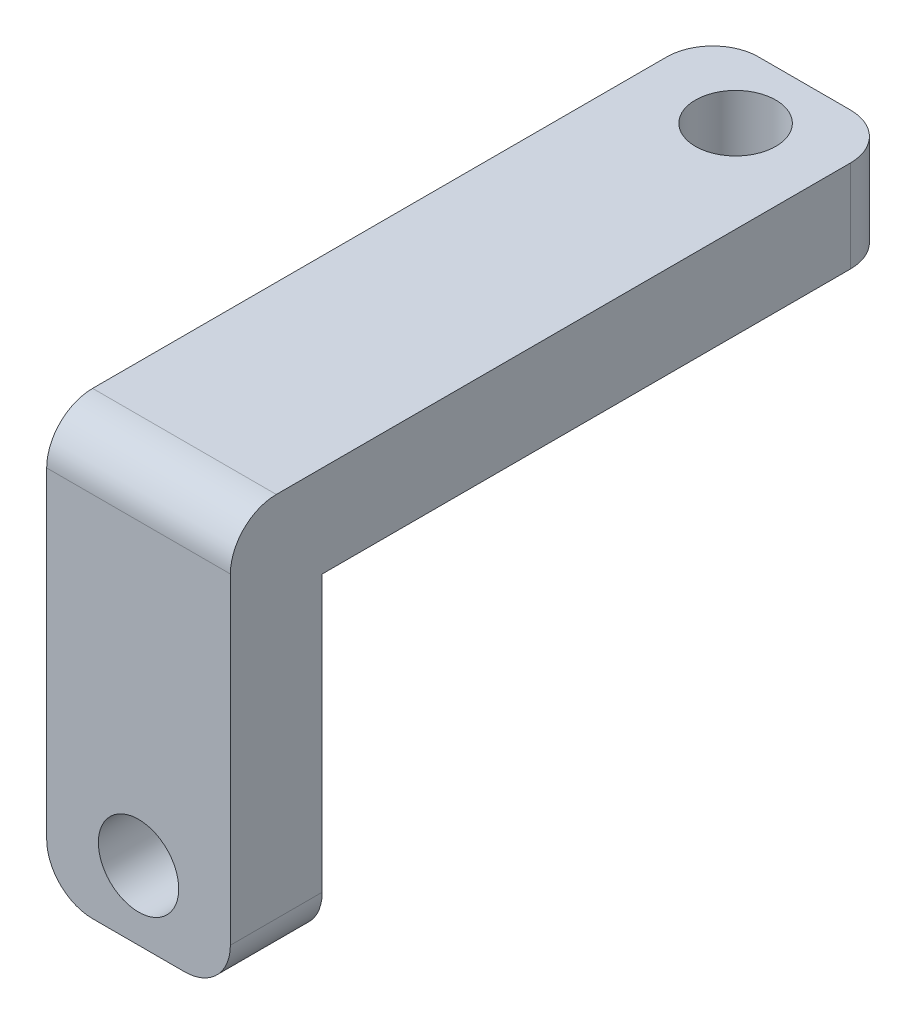
ISO-10303-21;
HEADER;
FILE_DESCRIPTION(('STEP AP214'),'2;1');
FILE_NAME('part.step','',(''),(''),'','','');
FILE_SCHEMA(('AUTOMOTIVE_DESIGN { 1 0 10303 214 1 1 1 1 }'));
ENDSEC;
DATA;
#1=APPLICATION_CONTEXT('core data for automotive mechanical design processes');
#2=APPLICATION_PROTOCOL_DEFINITION('international standard','automotive_design',2000,#1);
#3=PRODUCT_CONTEXT('',#1,'mechanical');
#4=PRODUCT('Part','Part','',(#3));
#5=PRODUCT_RELATED_PRODUCT_CATEGORY('part','',(#4));
#6=PRODUCT_DEFINITION_FORMATION('','',#4);
#7=PRODUCT_DEFINITION_CONTEXT('part definition',#1,'design');
#8=PRODUCT_DEFINITION('design','',#6,#7);
#9=PRODUCT_DEFINITION_SHAPE('','',#8);
#10=(LENGTH_UNIT() NAMED_UNIT(*) SI_UNIT(.MILLI.,.METRE.));
#11=(NAMED_UNIT(*) PLANE_ANGLE_UNIT() SI_UNIT($,.RADIAN.));
#12=(NAMED_UNIT(*) SI_UNIT($,.STERADIAN.) SOLID_ANGLE_UNIT());
#13=UNCERTAINTY_MEASURE_WITH_UNIT(LENGTH_MEASURE(1.E-05),#10,'distance_accuracy_value','');
#14=(GEOMETRIC_REPRESENTATION_CONTEXT(3) GLOBAL_UNCERTAINTY_ASSIGNED_CONTEXT((#13)) GLOBAL_UNIT_ASSIGNED_CONTEXT((#10,
#11,#12)) REPRESENTATION_CONTEXT('',''));
#15=CARTESIAN_POINT('',(0.,0.,0.));
#16=DIRECTION('',(0.,0.,1.));
#17=DIRECTION('',(1.,0.,0.));
#18=AXIS2_PLACEMENT_3D('',#15,#16,#17);
#19=CARTESIAN_POINT('',(0.,4.,0.));
#20=DIRECTION('',(0.,1.,0.));
#21=DIRECTION('',(0.,0.,1.));
#22=AXIS2_PLACEMENT_3D('',#19,#20,#21);
#23=PLANE('',#22);
#24=DIRECTION('',(0.,0.,1.));
#25=VECTOR('',#24,1.);
#26=CARTESIAN_POINT('',(-4.,4.,-12.5));
#27=LINE('',#26,#25);
#28=CARTESIAN_POINT('',(-4.,4.,-10.5));
#29=VERTEX_POINT('',#28);
#30=CARTESIAN_POINT('',(-4.,4.,14.5));
#31=VERTEX_POINT('',#30);
#32=EDGE_CURVE('E152',#29,#31,#27,.T.);
#33=ORIENTED_EDGE('',*,*,#32,.T.);
#34=DIRECTION('',(-1.,0.,0.));
#35=VECTOR('',#34,1.);
#36=CARTESIAN_POINT('',(0.,4.,14.5));
#37=LINE('',#36,#35);
#38=CARTESIAN_POINT('',(4.,4.,14.5));
#39=VERTEX_POINT('',#38);
#40=EDGE_CURVE('E172',#31,#39,#37,.F.);
#41=ORIENTED_EDGE('',*,*,#40,.T.);
#42=DIRECTION('',(0.,0.,-1.));
#43=VECTOR('',#42,1.);
#44=CARTESIAN_POINT('',(4.,4.,-12.5));
#45=LINE('',#44,#43);
#46=CARTESIAN_POINT('',(4.,4.,-10.5));
#47=VERTEX_POINT('',#46);
#48=EDGE_CURVE('E200',#39,#47,#45,.T.);
#49=ORIENTED_EDGE('',*,*,#48,.T.);
#50=CARTESIAN_POINT('',(2.,4.,-10.5));
#51=DIRECTION('',(0.,1.,0.));
#52=DIRECTION('',(0.,0.,1.));
#53=AXIS2_PLACEMENT_3D('',#50,#51,#52);
#54=CIRCLE('',#53,2.);
#55=CARTESIAN_POINT('',(2.,4.,-12.5));
#56=VERTEX_POINT('',#55);
#57=EDGE_CURVE('E168',#47,#56,#54,.T.);
#58=ORIENTED_EDGE('',*,*,#57,.T.);
#59=DIRECTION('',(-1.,0.,0.));
#60=VECTOR('',#59,1.);
#61=CARTESIAN_POINT('',(-4.,4.,-12.5));
#62=LINE('',#61,#60);
#63=CARTESIAN_POINT('',(-2.,4.,-12.5));
#64=VERTEX_POINT('',#63);
#65=EDGE_CURVE('E156',#56,#64,#62,.T.);
#66=ORIENTED_EDGE('',*,*,#65,.T.);
#67=CARTESIAN_POINT('',(-2.,4.,-10.5));
#68=DIRECTION('',(0.,1.,0.));
#69=DIRECTION('',(0.,0.,1.));
#70=AXIS2_PLACEMENT_3D('',#67,#68,#69);
#71=CIRCLE('',#70,2.);
#72=EDGE_CURVE('E170',#64,#29,#71,.T.);
#73=ORIENTED_EDGE('',*,*,#72,.T.);
#74=EDGE_LOOP('',(#33,#41,#49,#58,#66,#73));
#75=FACE_BOUND('',#74,.T.);
#76=CARTESIAN_POINT('',(0.,4.,-9.5));
#77=DIRECTION('',(0.,1.,0.));
#78=DIRECTION('',(0.,0.,1.));
#79=AXIS2_PLACEMENT_3D('',#76,#77,#78);
#80=CIRCLE('',#79,1.75);
#81=CARTESIAN_POINT('',(0.,4.,-7.75));
#82=VERTEX_POINT('',#81);
#83=EDGE_CURVE('E147',#82,#82,#80,.T.);
#84=ORIENTED_EDGE('',*,*,#83,.F.);
#85=EDGE_LOOP('',(#84));
#86=FACE_BOUND('',#85,.T.);
#87=ADVANCED_FACE('F37',(#75,#86),#23,.T.);
#88=CARTESIAN_POINT('',(0.,0.,0.));
#89=DIRECTION('',(0.,1.,0.));
#90=DIRECTION('',(0.,0.,1.));
#91=AXIS2_PLACEMENT_3D('',#88,#89,#90);
#92=PLANE('',#91);
#93=DIRECTION('',(0.,0.,1.));
#94=VECTOR('',#93,1.);
#95=CARTESIAN_POINT('',(-4.,0.,-12.5));
#96=LINE('',#95,#94);
#97=CARTESIAN_POINT('',(-4.,0.,-10.5));
#98=VERTEX_POINT('',#97);
#99=CARTESIAN_POINT('',(-4.,0.,12.5));
#100=VERTEX_POINT('',#99);
#101=EDGE_CURVE('E145',#98,#100,#96,.T.);
#102=ORIENTED_EDGE('',*,*,#101,.F.);
#103=CARTESIAN_POINT('',(-2.,0.,-10.5));
#104=DIRECTION('',(0.,1.,0.));
#105=DIRECTION('',(0.,0.,1.));
#106=AXIS2_PLACEMENT_3D('',#103,#104,#105);
#107=CIRCLE('',#106,2.);
#108=CARTESIAN_POINT('',(-2.,0.,-12.5));
#109=VERTEX_POINT('',#108);
#110=EDGE_CURVE('E52',#98,#109,#107,.F.);
#111=ORIENTED_EDGE('',*,*,#110,.T.);
#112=DIRECTION('',(-1.,0.,0.));
#113=VECTOR('',#112,1.);
#114=CARTESIAN_POINT('',(-4.,0.,-12.5));
#115=LINE('',#114,#113);
#116=CARTESIAN_POINT('',(2.,0.,-12.5));
#117=VERTEX_POINT('',#116);
#118=EDGE_CURVE('E140',#117,#109,#115,.T.);
#119=ORIENTED_EDGE('',*,*,#118,.F.);
#120=CARTESIAN_POINT('',(2.,0.,-10.5));
#121=DIRECTION('',(0.,1.,0.));
#122=DIRECTION('',(0.,0.,1.));
#123=AXIS2_PLACEMENT_3D('',#120,#121,#122);
#124=CIRCLE('',#123,2.);
#125=CARTESIAN_POINT('',(4.,0.,-10.5));
#126=VERTEX_POINT('',#125);
#127=EDGE_CURVE('E60',#117,#126,#124,.F.);
#128=ORIENTED_EDGE('',*,*,#127,.T.);
#129=DIRECTION('',(0.,0.,-1.));
#130=VECTOR('',#129,1.);
#131=CARTESIAN_POINT('',(4.,0.,-12.5));
#132=LINE('',#131,#130);
#133=CARTESIAN_POINT('',(4.,0.,12.5));
#134=VERTEX_POINT('',#133);
#135=EDGE_CURVE('E126',#134,#126,#132,.T.);
#136=ORIENTED_EDGE('',*,*,#135,.F.);
#137=DIRECTION('',(1.,0.,0.));
#138=VECTOR('',#137,1.);
#139=CARTESIAN_POINT('',(-4.,0.,12.5));
#140=LINE('',#139,#138);
#141=EDGE_CURVE('E138',#100,#134,#140,.T.);
#142=ORIENTED_EDGE('',*,*,#141,.F.);
#143=EDGE_LOOP('',(#102,#111,#119,#128,#136,#142));
#144=FACE_BOUND('',#143,.T.);
#145=CARTESIAN_POINT('',(0.,0.,-9.5));
#146=DIRECTION('',(0.,1.,0.));
#147=DIRECTION('',(0.,0.,1.));
#148=AXIS2_PLACEMENT_3D('',#145,#146,#147);
#149=CIRCLE('',#148,1.75);
#150=CARTESIAN_POINT('',(0.,0.,-7.75));
#151=VERTEX_POINT('',#150);
#152=EDGE_CURVE('E206',#151,#151,#149,.T.);
#153=ORIENTED_EDGE('',*,*,#152,.T.);
#154=EDGE_LOOP('',(#153));
#155=FACE_BOUND('',#154,.T.);
#156=ADVANCED_FACE('F136',(#144,#155),#92,.F.);
#157=CARTESIAN_POINT('',(-4.,4.,-12.5));
#158=DIRECTION('',(1.,0.,0.));
#159=DIRECTION('',(0.,0.,-1.));
#160=AXIS2_PLACEMENT_3D('',#157,#158,#159);
#161=PLANE('',#160);
#162=DIRECTION('',(0.,-1.,0.));
#163=VECTOR('',#162,1.);
#164=CARTESIAN_POINT('',(-4.,4.,16.5));
#165=LINE('',#164,#163);
#166=CARTESIAN_POINT('',(-4.,2.,16.5));
#167=VERTEX_POINT('',#166);
#168=CARTESIAN_POINT('',(-4.,-12.,16.5));
#169=VERTEX_POINT('',#168);
#170=EDGE_CURVE('E132',#167,#169,#165,.T.);
#171=ORIENTED_EDGE('',*,*,#170,.F.);
#172=CARTESIAN_POINT('',(-4.,2.,14.5));
#173=DIRECTION('',(1.,0.,0.));
#174=DIRECTION('',(0.,0.,-1.));
#175=AXIS2_PLACEMENT_3D('',#172,#173,#174);
#176=CIRCLE('',#175,2.);
#177=EDGE_CURVE('E166',#167,#31,#176,.F.);
#178=ORIENTED_EDGE('',*,*,#177,.T.);
#179=ORIENTED_EDGE('',*,*,#32,.F.);
#180=DIRECTION('',(0.,-1.,0.));
#181=VECTOR('',#180,1.);
#182=CARTESIAN_POINT('',(-4.,4.,-10.5));
#183=LINE('',#182,#181);
#184=EDGE_CURVE('E161',#29,#98,#183,.T.);
#185=ORIENTED_EDGE('',*,*,#184,.T.);
#186=ORIENTED_EDGE('',*,*,#101,.T.);
#187=DIRECTION('',(0.,-1.,0.));
#188=VECTOR('',#187,1.);
#189=CARTESIAN_POINT('',(-4.,4.,12.5));
#190=LINE('',#189,#188);
#191=CARTESIAN_POINT('',(-4.,-12.,12.5));
#192=VERTEX_POINT('',#191);
#193=EDGE_CURVE('E144',#100,#192,#190,.T.);
#194=ORIENTED_EDGE('',*,*,#193,.T.);
#195=DIRECTION('',(0.,0.,-1.));
#196=VECTOR('',#195,1.);
#197=CARTESIAN_POINT('',(-4.,-12.,-12.5));
#198=LINE('',#197,#196);
#199=EDGE_CURVE('E164',#192,#169,#198,.F.);
#200=ORIENTED_EDGE('',*,*,#199,.T.);
#201=EDGE_LOOP('',(#171,#178,#179,#185,#186,#194,#200));
#202=FACE_BOUND('',#201,.T.);
#203=ADVANCED_FACE('F252',(#202),#161,.F.);
#204=CARTESIAN_POINT('',(4.,4.,-12.5));
#205=DIRECTION('',(-1.,0.,0.));
#206=DIRECTION('',(0.,0.,1.));
#207=AXIS2_PLACEMENT_3D('',#204,#205,#206);
#208=PLANE('',#207);
#209=ORIENTED_EDGE('',*,*,#48,.F.);
#210=CARTESIAN_POINT('',(4.,2.,14.5));
#211=DIRECTION('',(-1.,0.,0.));
#212=DIRECTION('',(0.,0.,1.));
#213=AXIS2_PLACEMENT_3D('',#210,#211,#212);
#214=CIRCLE('',#213,2.);
#215=CARTESIAN_POINT('',(4.,2.,16.5));
#216=VERTEX_POINT('',#215);
#217=EDGE_CURVE('E177',#39,#216,#214,.F.);
#218=ORIENTED_EDGE('',*,*,#217,.T.);
#219=DIRECTION('',(0.,1.,0.));
#220=VECTOR('',#219,1.);
#221=CARTESIAN_POINT('',(4.,4.,16.5));
#222=LINE('',#221,#220);
#223=CARTESIAN_POINT('',(4.,-12.,16.5));
#224=VERTEX_POINT('',#223);
#225=EDGE_CURVE('E209',#224,#216,#222,.T.);
#226=ORIENTED_EDGE('',*,*,#225,.F.);
#227=DIRECTION('',(0.,0.,-1.));
#228=VECTOR('',#227,1.);
#229=CARTESIAN_POINT('',(4.,-12.,-12.5));
#230=LINE('',#229,#228);
#231=CARTESIAN_POINT('',(4.,-12.,12.5));
#232=VERTEX_POINT('',#231);
#233=EDGE_CURVE('E129',#224,#232,#230,.T.);
#234=ORIENTED_EDGE('',*,*,#233,.T.);
#235=DIRECTION('',(0.,1.,0.));
#236=VECTOR('',#235,1.);
#237=CARTESIAN_POINT('',(4.,4.,12.5));
#238=LINE('',#237,#236);
#239=EDGE_CURVE('E122',#232,#134,#238,.T.);
#240=ORIENTED_EDGE('',*,*,#239,.T.);
#241=ORIENTED_EDGE('',*,*,#135,.T.);
#242=DIRECTION('',(0.,-1.,0.));
#243=VECTOR('',#242,1.);
#244=CARTESIAN_POINT('',(4.,4.,-10.5));
#245=LINE('',#244,#243);
#246=EDGE_CURVE('E174',#126,#47,#245,.F.);
#247=ORIENTED_EDGE('',*,*,#246,.T.);
#248=EDGE_LOOP('',(#209,#218,#226,#234,#240,#241,#247));
#249=FACE_BOUND('',#248,.T.);
#250=ADVANCED_FACE('F125',(#249),#208,.F.);
#251=CARTESIAN_POINT('',(-4.,4.,-12.5));
#252=DIRECTION('',(0.,0.,1.));
#253=DIRECTION('',(1.,0.,0.));
#254=AXIS2_PLACEMENT_3D('',#251,#252,#253);
#255=PLANE('',#254);
#256=ORIENTED_EDGE('',*,*,#118,.T.);
#257=DIRECTION('',(0.,-1.,0.));
#258=VECTOR('',#257,1.);
#259=CARTESIAN_POINT('',(-2.,4.,-12.5));
#260=LINE('',#259,#258);
#261=EDGE_CURVE('E11',#109,#64,#260,.F.);
#262=ORIENTED_EDGE('',*,*,#261,.T.);
#263=ORIENTED_EDGE('',*,*,#65,.F.);
#264=DIRECTION('',(0.,-1.,0.));
#265=VECTOR('',#264,1.);
#266=CARTESIAN_POINT('',(2.,4.,-12.5));
#267=LINE('',#266,#265);
#268=EDGE_CURVE('E45',#56,#117,#267,.T.);
#269=ORIENTED_EDGE('',*,*,#268,.T.);
#270=EDGE_LOOP('',(#256,#262,#263,#269));
#271=FACE_BOUND('',#270,.T.);
#272=ADVANCED_FACE('F191',(#271),#255,.F.);
#273=CARTESIAN_POINT('',(0.,4.,-9.5));
#274=DIRECTION('',(0.,-1.,0.));
#275=DIRECTION('',(0.,0.,-1.));
#276=AXIS2_PLACEMENT_3D('',#273,#274,#275);
#277=CYLINDRICAL_SURFACE('',#276,1.75);
#278=ORIENTED_EDGE('',*,*,#83,.T.);
#279=EDGE_LOOP('',(#278));
#280=FACE_BOUND('',#279,.T.);
#281=ORIENTED_EDGE('',*,*,#152,.F.);
#282=EDGE_LOOP('',(#281));
#283=FACE_BOUND('',#282,.T.);
#284=ADVANCED_FACE('F243',(#280,#283),#277,.F.);
#285=CARTESIAN_POINT('',(0.,0.,12.5));
#286=DIRECTION('',(0.,0.,1.));
#287=DIRECTION('',(1.,0.,0.));
#288=AXIS2_PLACEMENT_3D('',#285,#286,#287);
#289=PLANE('',#288);
#290=CARTESIAN_POINT('',(0.,-11.,12.5));
#291=DIRECTION('',(0.,0.,1.));
#292=DIRECTION('',(1.,0.,0.));
#293=AXIS2_PLACEMENT_3D('',#290,#291,#292);
#294=CIRCLE('',#293,1.75);
#295=CARTESIAN_POINT('',(1.75,-11.,12.5));
#296=VERTEX_POINT('',#295);
#297=EDGE_CURVE('E223',#296,#296,#294,.T.);
#298=ORIENTED_EDGE('',*,*,#297,.T.);
#299=EDGE_LOOP('',(#298));
#300=FACE_BOUND('',#299,.T.);
#301=ORIENTED_EDGE('',*,*,#239,.F.);
#302=CARTESIAN_POINT('',(2.,-12.,12.5));
#303=DIRECTION('',(0.,0.,1.));
#304=DIRECTION('',(1.,0.,0.));
#305=AXIS2_PLACEMENT_3D('',#302,#303,#304);
#306=CIRCLE('',#305,2.);
#307=CARTESIAN_POINT('',(2.,-14.,12.5));
#308=VERTEX_POINT('',#307);
#309=EDGE_CURVE('E181',#232,#308,#306,.F.);
#310=ORIENTED_EDGE('',*,*,#309,.T.);
#311=DIRECTION('',(1.,0.,0.));
#312=VECTOR('',#311,1.);
#313=CARTESIAN_POINT('',(-4.,-14.,12.5));
#314=LINE('',#313,#312);
#315=CARTESIAN_POINT('',(-2.,-14.,12.5));
#316=VERTEX_POINT('',#315);
#317=EDGE_CURVE('E133',#316,#308,#314,.T.);
#318=ORIENTED_EDGE('',*,*,#317,.F.);
#319=CARTESIAN_POINT('',(-2.,-12.,12.5));
#320=DIRECTION('',(0.,0.,1.));
#321=DIRECTION('',(1.,0.,0.));
#322=AXIS2_PLACEMENT_3D('',#319,#320,#321);
#323=CIRCLE('',#322,2.);
#324=EDGE_CURVE('E179',#316,#192,#323,.F.);
#325=ORIENTED_EDGE('',*,*,#324,.T.);
#326=ORIENTED_EDGE('',*,*,#193,.F.);
#327=ORIENTED_EDGE('',*,*,#141,.T.);
#328=EDGE_LOOP('',(#301,#310,#318,#325,#326,#327));
#329=FACE_BOUND('',#328,.T.);
#330=ADVANCED_FACE('F142',(#300,#329),#289,.F.);
#331=CARTESIAN_POINT('',(0.,0.,16.5));
#332=DIRECTION('',(0.,0.,1.));
#333=DIRECTION('',(1.,0.,0.));
#334=AXIS2_PLACEMENT_3D('',#331,#332,#333);
#335=PLANE('',#334);
#336=ORIENTED_EDGE('',*,*,#225,.T.);
#337=DIRECTION('',(-1.,0.,0.));
#338=VECTOR('',#337,1.);
#339=CARTESIAN_POINT('',(0.,2.,16.5));
#340=LINE('',#339,#338);
#341=EDGE_CURVE('E158',#216,#167,#340,.T.);
#342=ORIENTED_EDGE('',*,*,#341,.T.);
#343=ORIENTED_EDGE('',*,*,#170,.T.);
#344=CARTESIAN_POINT('',(-2.,-12.,16.5));
#345=DIRECTION('',(0.,0.,1.));
#346=DIRECTION('',(1.,0.,0.));
#347=AXIS2_PLACEMENT_3D('',#344,#345,#346);
#348=CIRCLE('',#347,2.);
#349=CARTESIAN_POINT('',(-2.,-14.,16.5));
#350=VERTEX_POINT('',#349);
#351=EDGE_CURVE('E153',#169,#350,#348,.T.);
#352=ORIENTED_EDGE('',*,*,#351,.T.);
#353=DIRECTION('',(1.,0.,0.));
#354=VECTOR('',#353,1.);
#355=CARTESIAN_POINT('',(-4.,-14.,16.5));
#356=LINE('',#355,#354);
#357=CARTESIAN_POINT('',(2.,-14.,16.5));
#358=VERTEX_POINT('',#357);
#359=EDGE_CURVE('E218',#350,#358,#356,.T.);
#360=ORIENTED_EDGE('',*,*,#359,.T.);
#361=CARTESIAN_POINT('',(2.,-12.,16.5));
#362=DIRECTION('',(0.,0.,1.));
#363=DIRECTION('',(1.,0.,0.));
#364=AXIS2_PLACEMENT_3D('',#361,#362,#363);
#365=CIRCLE('',#364,2.);
#366=EDGE_CURVE('E155',#358,#224,#365,.T.);
#367=ORIENTED_EDGE('',*,*,#366,.T.);
#368=EDGE_LOOP('',(#336,#342,#343,#352,#360,#367));
#369=FACE_BOUND('',#368,.T.);
#370=CARTESIAN_POINT('',(0.,-11.,16.5));
#371=DIRECTION('',(0.,0.,1.));
#372=DIRECTION('',(1.,0.,0.));
#373=AXIS2_PLACEMENT_3D('',#370,#371,#372);
#374=CIRCLE('',#373,1.75);
#375=CARTESIAN_POINT('',(1.75,-11.,16.5));
#376=VERTEX_POINT('',#375);
#377=EDGE_CURVE('E215',#376,#376,#374,.T.);
#378=ORIENTED_EDGE('',*,*,#377,.F.);
#379=EDGE_LOOP('',(#378));
#380=FACE_BOUND('',#379,.T.);
#381=ADVANCED_FACE('F232',(#369,#380),#335,.T.);
#382=CARTESIAN_POINT('',(-4.,-14.,16.5));
#383=DIRECTION('',(0.,1.,0.));
#384=DIRECTION('',(0.,0.,1.));
#385=AXIS2_PLACEMENT_3D('',#382,#383,#384);
#386=PLANE('',#385);
#387=ORIENTED_EDGE('',*,*,#317,.T.);
#388=DIRECTION('',(0.,0.,-1.));
#389=VECTOR('',#388,1.);
#390=CARTESIAN_POINT('',(2.,-14.,16.5));
#391=LINE('',#390,#389);
#392=EDGE_CURVE('E186',#308,#358,#391,.F.);
#393=ORIENTED_EDGE('',*,*,#392,.T.);
#394=ORIENTED_EDGE('',*,*,#359,.F.);
#395=DIRECTION('',(0.,0.,-1.));
#396=VECTOR('',#395,1.);
#397=CARTESIAN_POINT('',(-2.,-14.,16.5));
#398=LINE('',#397,#396);
#399=EDGE_CURVE('E183',#350,#316,#398,.T.);
#400=ORIENTED_EDGE('',*,*,#399,.T.);
#401=EDGE_LOOP('',(#387,#393,#394,#400));
#402=FACE_BOUND('',#401,.T.);
#403=ADVANCED_FACE('F234',(#402),#386,.F.);
#404=CARTESIAN_POINT('',(0.,-11.,16.5));
#405=DIRECTION('',(0.,0.,-1.));
#406=DIRECTION('',(-1.,0.,0.));
#407=AXIS2_PLACEMENT_3D('',#404,#405,#406);
#408=CYLINDRICAL_SURFACE('',#407,1.75);
#409=ORIENTED_EDGE('',*,*,#377,.T.);
#410=EDGE_LOOP('',(#409));
#411=FACE_BOUND('',#410,.T.);
#412=ORIENTED_EDGE('',*,*,#297,.F.);
#413=EDGE_LOOP('',(#412));
#414=FACE_BOUND('',#413,.T.);
#415=ADVANCED_FACE('F229',(#411,#414),#408,.F.);
#416=CARTESIAN_POINT('',(0.,2.,14.5));
#417=DIRECTION('',(-1.,0.,0.));
#418=DIRECTION('',(0.,0.,1.));
#419=AXIS2_PLACEMENT_3D('',#416,#417,#418);
#420=CYLINDRICAL_SURFACE('',#419,2.);
#421=ORIENTED_EDGE('',*,*,#217,.F.);
#422=ORIENTED_EDGE('',*,*,#40,.F.);
#423=ORIENTED_EDGE('',*,*,#177,.F.);
#424=ORIENTED_EDGE('',*,*,#341,.F.);
#425=EDGE_LOOP('',(#421,#422,#423,#424));
#426=FACE_BOUND('',#425,.T.);
#427=ADVANCED_FACE('F263',(#426),#420,.T.);
#428=CARTESIAN_POINT('',(2.,-12.,-12.5));
#429=DIRECTION('',(0.,0.,-1.));
#430=DIRECTION('',(-1.,0.,0.));
#431=AXIS2_PLACEMENT_3D('',#428,#429,#430);
#432=CYLINDRICAL_SURFACE('',#431,2.);
#433=ORIENTED_EDGE('',*,*,#366,.F.);
#434=ORIENTED_EDGE('',*,*,#392,.F.);
#435=ORIENTED_EDGE('',*,*,#309,.F.);
#436=ORIENTED_EDGE('',*,*,#233,.F.);
#437=EDGE_LOOP('',(#433,#434,#435,#436));
#438=FACE_BOUND('',#437,.T.);
#439=ADVANCED_FACE('F266',(#438),#432,.T.);
#440=CARTESIAN_POINT('',(-2.,-12.,16.5));
#441=DIRECTION('',(0.,0.,-1.));
#442=DIRECTION('',(-1.,0.,0.));
#443=AXIS2_PLACEMENT_3D('',#440,#441,#442);
#444=CYLINDRICAL_SURFACE('',#443,2.);
#445=ORIENTED_EDGE('',*,*,#351,.F.);
#446=ORIENTED_EDGE('',*,*,#199,.F.);
#447=ORIENTED_EDGE('',*,*,#324,.F.);
#448=ORIENTED_EDGE('',*,*,#399,.F.);
#449=EDGE_LOOP('',(#445,#446,#447,#448));
#450=FACE_BOUND('',#449,.T.);
#451=ADVANCED_FACE('F270',(#450),#444,.T.);
#452=CARTESIAN_POINT('',(-2.,4.,-10.5));
#453=DIRECTION('',(0.,-1.,0.));
#454=DIRECTION('',(0.,0.,-1.));
#455=AXIS2_PLACEMENT_3D('',#452,#453,#454);
#456=CYLINDRICAL_SURFACE('',#455,2.);
#457=ORIENTED_EDGE('',*,*,#72,.F.);
#458=ORIENTED_EDGE('',*,*,#261,.F.);
#459=ORIENTED_EDGE('',*,*,#110,.F.);
#460=ORIENTED_EDGE('',*,*,#184,.F.);
#461=EDGE_LOOP('',(#457,#458,#459,#460));
#462=FACE_BOUND('',#461,.T.);
#463=ADVANCED_FACE('F273',(#462),#456,.T.);
#464=CARTESIAN_POINT('',(2.,4.,-10.5));
#465=DIRECTION('',(0.,-1.,0.));
#466=DIRECTION('',(0.,0.,-1.));
#467=AXIS2_PLACEMENT_3D('',#464,#465,#466);
#468=CYLINDRICAL_SURFACE('',#467,2.);
#469=ORIENTED_EDGE('',*,*,#57,.F.);
#470=ORIENTED_EDGE('',*,*,#246,.F.);
#471=ORIENTED_EDGE('',*,*,#127,.F.);
#472=ORIENTED_EDGE('',*,*,#268,.F.);
#473=EDGE_LOOP('',(#469,#470,#471,#472));
#474=FACE_BOUND('',#473,.T.);
#475=ADVANCED_FACE('F39',(#474),#468,.T.);
#476=CLOSED_SHELL('',(#87,#156,#203,#250,#272,#284,#330,#381,#403,#415,#427,#439,#451,#463,#475));
#477=MANIFOLD_SOLID_BREP('B2',#476);
#478=ADVANCED_BREP_SHAPE_REPRESENTATION('',(#18,#477),#14);
#479=SHAPE_DEFINITION_REPRESENTATION(#9,#478);
ENDSEC;
END-ISO-10303-21;
